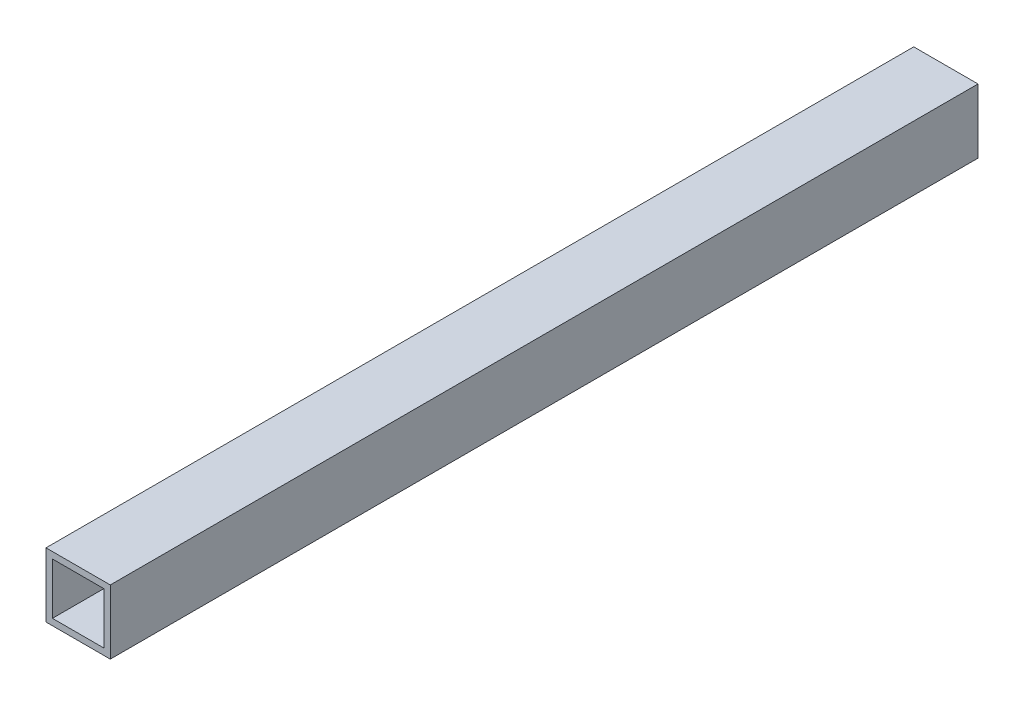
ISO-10303-21;
HEADER;
FILE_DESCRIPTION(('STEP AP214'),'2;1');
FILE_NAME('part.step','',(''),(''),'','','');
FILE_SCHEMA(('AUTOMOTIVE_DESIGN { 1 0 10303 214 1 1 1 1 }'));
ENDSEC;
DATA;
#1=APPLICATION_CONTEXT('core data for automotive mechanical design processes');
#2=APPLICATION_PROTOCOL_DEFINITION('international standard','automotive_design',2000,#1);
#3=PRODUCT_CONTEXT('',#1,'mechanical');
#4=PRODUCT('Part','Part','',(#3));
#5=PRODUCT_RELATED_PRODUCT_CATEGORY('part','',(#4));
#6=PRODUCT_DEFINITION_FORMATION('','',#4);
#7=PRODUCT_DEFINITION_CONTEXT('part definition',#1,'design');
#8=PRODUCT_DEFINITION('design','',#6,#7);
#9=PRODUCT_DEFINITION_SHAPE('','',#8);
#10=(LENGTH_UNIT() NAMED_UNIT(*) SI_UNIT(.MILLI.,.METRE.));
#11=(NAMED_UNIT(*) PLANE_ANGLE_UNIT() SI_UNIT($,.RADIAN.));
#12=(NAMED_UNIT(*) SI_UNIT($,.STERADIAN.) SOLID_ANGLE_UNIT());
#13=UNCERTAINTY_MEASURE_WITH_UNIT(LENGTH_MEASURE(1.E-05),#10,'distance_accuracy_value','');
#14=(GEOMETRIC_REPRESENTATION_CONTEXT(3) GLOBAL_UNCERTAINTY_ASSIGNED_CONTEXT((#13)) GLOBAL_UNIT_ASSIGNED_CONTEXT((#10,
#11,#12)) REPRESENTATION_CONTEXT('',''));
#15=CARTESIAN_POINT('',(0.,0.,0.));
#16=DIRECTION('',(0.,0.,1.));
#17=DIRECTION('',(1.,0.,0.));
#18=AXIS2_PLACEMENT_3D('',#15,#16,#17);
#19=CARTESIAN_POINT('',(-15.875,-15.875,428.625));
#20=DIRECTION('',(0.,0.,1.));
#21=DIRECTION('',(1.,0.,0.));
#22=AXIS2_PLACEMENT_3D('',#19,#20,#21);
#23=PLANE('',#22);
#24=DIRECTION('',(0.,-1.,0.));
#25=VECTOR('',#24,1.);
#26=CARTESIAN_POINT('',(-15.875,15.875,428.625));
#27=LINE('',#26,#25);
#28=CARTESIAN_POINT('',(-15.875,15.875,428.625));
#29=VERTEX_POINT('',#28);
#30=CARTESIAN_POINT('',(-15.875,-15.875,428.625));
#31=VERTEX_POINT('',#30);
#32=EDGE_CURVE('E135',#29,#31,#27,.T.);
#33=ORIENTED_EDGE('',*,*,#32,.T.);
#34=DIRECTION('',(1.,0.,0.));
#35=VECTOR('',#34,1.);
#36=CARTESIAN_POINT('',(-15.875,-15.875,428.625));
#37=LINE('',#36,#35);
#38=CARTESIAN_POINT('',(15.875,-15.875,428.625));
#39=VERTEX_POINT('',#38);
#40=EDGE_CURVE('E138',#31,#39,#37,.T.);
#41=ORIENTED_EDGE('',*,*,#40,.T.);
#42=DIRECTION('',(0.,1.,0.));
#43=VECTOR('',#42,1.);
#44=CARTESIAN_POINT('',(15.875,15.875,428.625));
#45=LINE('',#44,#43);
#46=CARTESIAN_POINT('',(15.875,15.875,428.625));
#47=VERTEX_POINT('',#46);
#48=EDGE_CURVE('E140',#39,#47,#45,.T.);
#49=ORIENTED_EDGE('',*,*,#48,.T.);
#50=DIRECTION('',(-1.,0.,0.));
#51=VECTOR('',#50,1.);
#52=CARTESIAN_POINT('',(-15.875,15.875,428.625));
#53=LINE('',#52,#51);
#54=EDGE_CURVE('E142',#47,#29,#53,.T.);
#55=ORIENTED_EDGE('',*,*,#54,.T.);
#56=EDGE_LOOP('',(#33,#41,#49,#55));
#57=FACE_BOUND('',#56,.T.);
#58=DIRECTION('',(1.,0.,0.));
#59=VECTOR('',#58,1.);
#60=CARTESIAN_POINT('',(-12.7,-12.7,428.625));
#61=LINE('',#60,#59);
#62=CARTESIAN_POINT('',(-12.7,-12.7,428.625));
#63=VERTEX_POINT('',#62);
#64=CARTESIAN_POINT('',(12.7,-12.7,428.625));
#65=VERTEX_POINT('',#64);
#66=EDGE_CURVE('E117',#63,#65,#61,.T.);
#67=ORIENTED_EDGE('',*,*,#66,.F.);
#68=DIRECTION('',(0.,-1.,0.));
#69=VECTOR('',#68,1.);
#70=CARTESIAN_POINT('',(-12.7,12.7,428.625));
#71=LINE('',#70,#69);
#72=CARTESIAN_POINT('',(-12.7,12.7,428.625));
#73=VERTEX_POINT('',#72);
#74=EDGE_CURVE('E106',#73,#63,#71,.T.);
#75=ORIENTED_EDGE('',*,*,#74,.F.);
#76=DIRECTION('',(-1.,0.,0.));
#77=VECTOR('',#76,1.);
#78=CARTESIAN_POINT('',(-12.7,12.7,428.625));
#79=LINE('',#78,#77);
#80=CARTESIAN_POINT('',(12.7,12.7,428.625));
#81=VERTEX_POINT('',#80);
#82=EDGE_CURVE('E121',#81,#73,#79,.T.);
#83=ORIENTED_EDGE('',*,*,#82,.F.);
#84=DIRECTION('',(0.,1.,0.));
#85=VECTOR('',#84,1.);
#86=CARTESIAN_POINT('',(12.7,12.7,428.625));
#87=LINE('',#86,#85);
#88=EDGE_CURVE('E119',#65,#81,#87,.T.);
#89=ORIENTED_EDGE('',*,*,#88,.F.);
#90=EDGE_LOOP('',(#67,#75,#83,#89));
#91=FACE_BOUND('',#90,.T.);
#92=ADVANCED_FACE('F26',(#57,#91),#23,.T.);
#93=CARTESIAN_POINT('',(-15.875,-15.875,0.));
#94=DIRECTION('',(0.,0.,1.));
#95=DIRECTION('',(1.,0.,0.));
#96=AXIS2_PLACEMENT_3D('',#93,#94,#95);
#97=PLANE('',#96);
#98=DIRECTION('',(0.,-1.,0.));
#99=VECTOR('',#98,1.);
#100=CARTESIAN_POINT('',(-15.875,15.875,0.));
#101=LINE('',#100,#99);
#102=CARTESIAN_POINT('',(-15.875,15.875,0.));
#103=VERTEX_POINT('',#102);
#104=CARTESIAN_POINT('',(-15.875,-15.875,0.));
#105=VERTEX_POINT('',#104);
#106=EDGE_CURVE('E107',#103,#105,#101,.T.);
#107=ORIENTED_EDGE('',*,*,#106,.F.);
#108=DIRECTION('',(-1.,0.,0.));
#109=VECTOR('',#108,1.);
#110=CARTESIAN_POINT('',(-15.875,15.875,0.));
#111=LINE('',#110,#109);
#112=CARTESIAN_POINT('',(15.875,15.875,0.));
#113=VERTEX_POINT('',#112);
#114=EDGE_CURVE('E133',#113,#103,#111,.T.);
#115=ORIENTED_EDGE('',*,*,#114,.F.);
#116=DIRECTION('',(0.,1.,0.));
#117=VECTOR('',#116,1.);
#118=CARTESIAN_POINT('',(15.875,15.875,0.));
#119=LINE('',#118,#117);
#120=CARTESIAN_POINT('',(15.875,-15.875,0.));
#121=VERTEX_POINT('',#120);
#122=EDGE_CURVE('E131',#121,#113,#119,.T.);
#123=ORIENTED_EDGE('',*,*,#122,.F.);
#124=DIRECTION('',(1.,0.,0.));
#125=VECTOR('',#124,1.);
#126=CARTESIAN_POINT('',(-15.875,-15.875,0.));
#127=LINE('',#126,#125);
#128=EDGE_CURVE('E129',#105,#121,#127,.T.);
#129=ORIENTED_EDGE('',*,*,#128,.F.);
#130=EDGE_LOOP('',(#107,#115,#123,#129));
#131=FACE_BOUND('',#130,.T.);
#132=DIRECTION('',(0.,-1.,0.));
#133=VECTOR('',#132,1.);
#134=CARTESIAN_POINT('',(-12.7,12.7,0.));
#135=LINE('',#134,#133);
#136=CARTESIAN_POINT('',(-12.7,12.7,0.));
#137=VERTEX_POINT('',#136);
#138=CARTESIAN_POINT('',(-12.7,-12.7,0.));
#139=VERTEX_POINT('',#138);
#140=EDGE_CURVE('E49',#137,#139,#135,.T.);
#141=ORIENTED_EDGE('',*,*,#140,.T.);
#142=DIRECTION('',(1.,0.,0.));
#143=VECTOR('',#142,1.);
#144=CARTESIAN_POINT('',(-12.7,-12.7,0.));
#145=LINE('',#144,#143);
#146=CARTESIAN_POINT('',(12.7,-12.7,0.));
#147=VERTEX_POINT('',#146);
#148=EDGE_CURVE('E93',#139,#147,#145,.T.);
#149=ORIENTED_EDGE('',*,*,#148,.T.);
#150=DIRECTION('',(0.,1.,0.));
#151=VECTOR('',#150,1.);
#152=CARTESIAN_POINT('',(12.7,12.7,0.));
#153=LINE('',#152,#151);
#154=CARTESIAN_POINT('',(12.7,12.7,0.));
#155=VERTEX_POINT('',#154);
#156=EDGE_CURVE('E102',#147,#155,#153,.T.);
#157=ORIENTED_EDGE('',*,*,#156,.T.);
#158=DIRECTION('',(-1.,0.,0.));
#159=VECTOR('',#158,1.);
#160=CARTESIAN_POINT('',(-12.7,12.7,0.));
#161=LINE('',#160,#159);
#162=EDGE_CURVE('E111',#155,#137,#161,.T.);
#163=ORIENTED_EDGE('',*,*,#162,.T.);
#164=EDGE_LOOP('',(#141,#149,#157,#163));
#165=FACE_BOUND('',#164,.T.);
#166=ADVANCED_FACE('F110',(#131,#165),#97,.F.);
#167=CARTESIAN_POINT('',(-15.875,15.875,428.625));
#168=DIRECTION('',(1.,0.,0.));
#169=DIRECTION('',(0.,1.,0.));
#170=AXIS2_PLACEMENT_3D('',#167,#168,#169);
#171=PLANE('',#170);
#172=ORIENTED_EDGE('',*,*,#106,.T.);
#173=DIRECTION('',(0.,0.,-1.));
#174=VECTOR('',#173,1.);
#175=CARTESIAN_POINT('',(-15.875,-15.875,428.625));
#176=LINE('',#175,#174);
#177=EDGE_CURVE('E11',#31,#105,#176,.T.);
#178=ORIENTED_EDGE('',*,*,#177,.F.);
#179=ORIENTED_EDGE('',*,*,#32,.F.);
#180=DIRECTION('',(0.,0.,-1.));
#181=VECTOR('',#180,1.);
#182=CARTESIAN_POINT('',(-15.875,15.875,428.625));
#183=LINE('',#182,#181);
#184=EDGE_CURVE('E144',#29,#103,#183,.T.);
#185=ORIENTED_EDGE('',*,*,#184,.T.);
#186=EDGE_LOOP('',(#172,#178,#179,#185));
#187=FACE_BOUND('',#186,.T.);
#188=ADVANCED_FACE('F28',(#187),#171,.F.);
#189=CARTESIAN_POINT('',(-15.875,-15.875,428.625));
#190=DIRECTION('',(0.,1.,0.));
#191=DIRECTION('',(0.,0.,1.));
#192=AXIS2_PLACEMENT_3D('',#189,#190,#191);
#193=PLANE('',#192);
#194=ORIENTED_EDGE('',*,*,#128,.T.);
#195=DIRECTION('',(0.,0.,-1.));
#196=VECTOR('',#195,1.);
#197=CARTESIAN_POINT('',(15.875,-15.875,428.625));
#198=LINE('',#197,#196);
#199=EDGE_CURVE('E34',#39,#121,#198,.T.);
#200=ORIENTED_EDGE('',*,*,#199,.F.);
#201=ORIENTED_EDGE('',*,*,#40,.F.);
#202=ORIENTED_EDGE('',*,*,#177,.T.);
#203=EDGE_LOOP('',(#194,#200,#201,#202));
#204=FACE_BOUND('',#203,.T.);
#205=ADVANCED_FACE('F169',(#204),#193,.F.);
#206=CARTESIAN_POINT('',(15.875,15.875,428.625));
#207=DIRECTION('',(-1.,0.,0.));
#208=DIRECTION('',(0.,-1.,0.));
#209=AXIS2_PLACEMENT_3D('',#206,#207,#208);
#210=PLANE('',#209);
#211=ORIENTED_EDGE('',*,*,#122,.T.);
#212=DIRECTION('',(0.,0.,-1.));
#213=VECTOR('',#212,1.);
#214=CARTESIAN_POINT('',(15.875,15.875,428.625));
#215=LINE('',#214,#213);
#216=EDGE_CURVE('E147',#47,#113,#215,.T.);
#217=ORIENTED_EDGE('',*,*,#216,.F.);
#218=ORIENTED_EDGE('',*,*,#48,.F.);
#219=ORIENTED_EDGE('',*,*,#199,.T.);
#220=EDGE_LOOP('',(#211,#217,#218,#219));
#221=FACE_BOUND('',#220,.T.);
#222=ADVANCED_FACE('F154',(#221),#210,.F.);
#223=CARTESIAN_POINT('',(-15.875,15.875,428.625));
#224=DIRECTION('',(0.,-1.,0.));
#225=DIRECTION('',(0.,0.,-1.));
#226=AXIS2_PLACEMENT_3D('',#223,#224,#225);
#227=PLANE('',#226);
#228=ORIENTED_EDGE('',*,*,#114,.T.);
#229=ORIENTED_EDGE('',*,*,#184,.F.);
#230=ORIENTED_EDGE('',*,*,#54,.F.);
#231=ORIENTED_EDGE('',*,*,#216,.T.);
#232=EDGE_LOOP('',(#228,#229,#230,#231));
#233=FACE_BOUND('',#232,.T.);
#234=ADVANCED_FACE('F162',(#233),#227,.F.);
#235=CARTESIAN_POINT('',(-12.7,12.7,428.625));
#236=DIRECTION('',(1.,0.,0.));
#237=DIRECTION('',(0.,1.,0.));
#238=AXIS2_PLACEMENT_3D('',#235,#236,#237);
#239=PLANE('',#238);
#240=ORIENTED_EDGE('',*,*,#140,.F.);
#241=DIRECTION('',(0.,0.,-1.));
#242=VECTOR('',#241,1.);
#243=CARTESIAN_POINT('',(-12.7,12.7,428.625));
#244=LINE('',#243,#242);
#245=EDGE_CURVE('E123',#73,#137,#244,.T.);
#246=ORIENTED_EDGE('',*,*,#245,.F.);
#247=ORIENTED_EDGE('',*,*,#74,.T.);
#248=DIRECTION('',(0.,0.,-1.));
#249=VECTOR('',#248,1.);
#250=CARTESIAN_POINT('',(-12.7,-12.7,428.625));
#251=LINE('',#250,#249);
#252=EDGE_CURVE('E95',#63,#139,#251,.T.);
#253=ORIENTED_EDGE('',*,*,#252,.T.);
#254=EDGE_LOOP('',(#240,#246,#247,#253));
#255=FACE_BOUND('',#254,.T.);
#256=ADVANCED_FACE('F104',(#255),#239,.T.);
#257=CARTESIAN_POINT('',(-12.7,-12.7,428.625));
#258=DIRECTION('',(0.,1.,0.));
#259=DIRECTION('',(0.,0.,1.));
#260=AXIS2_PLACEMENT_3D('',#257,#258,#259);
#261=PLANE('',#260);
#262=ORIENTED_EDGE('',*,*,#148,.F.);
#263=ORIENTED_EDGE('',*,*,#252,.F.);
#264=ORIENTED_EDGE('',*,*,#66,.T.);
#265=DIRECTION('',(0.,0.,-1.));
#266=VECTOR('',#265,1.);
#267=CARTESIAN_POINT('',(12.7,-12.7,428.625));
#268=LINE('',#267,#266);
#269=EDGE_CURVE('E98',#65,#147,#268,.T.);
#270=ORIENTED_EDGE('',*,*,#269,.T.);
#271=EDGE_LOOP('',(#262,#263,#264,#270));
#272=FACE_BOUND('',#271,.T.);
#273=ADVANCED_FACE('F94',(#272),#261,.T.);
#274=CARTESIAN_POINT('',(12.7,12.7,428.625));
#275=DIRECTION('',(-1.,0.,0.));
#276=DIRECTION('',(0.,-1.,0.));
#277=AXIS2_PLACEMENT_3D('',#274,#275,#276);
#278=PLANE('',#277);
#279=ORIENTED_EDGE('',*,*,#156,.F.);
#280=ORIENTED_EDGE('',*,*,#269,.F.);
#281=ORIENTED_EDGE('',*,*,#88,.T.);
#282=DIRECTION('',(0.,0.,-1.));
#283=VECTOR('',#282,1.);
#284=CARTESIAN_POINT('',(12.7,12.7,428.625));
#285=LINE('',#284,#283);
#286=EDGE_CURVE('E41',#81,#155,#285,.T.);
#287=ORIENTED_EDGE('',*,*,#286,.T.);
#288=EDGE_LOOP('',(#279,#280,#281,#287));
#289=FACE_BOUND('',#288,.T.);
#290=ADVANCED_FACE('F191',(#289),#278,.T.);
#291=CARTESIAN_POINT('',(-12.7,12.7,428.625));
#292=DIRECTION('',(0.,-1.,0.));
#293=DIRECTION('',(0.,0.,-1.));
#294=AXIS2_PLACEMENT_3D('',#291,#292,#293);
#295=PLANE('',#294);
#296=ORIENTED_EDGE('',*,*,#162,.F.);
#297=ORIENTED_EDGE('',*,*,#286,.F.);
#298=ORIENTED_EDGE('',*,*,#82,.T.);
#299=ORIENTED_EDGE('',*,*,#245,.T.);
#300=EDGE_LOOP('',(#296,#297,#298,#299));
#301=FACE_BOUND('',#300,.T.);
#302=ADVANCED_FACE('F196',(#301),#295,.T.);
#303=CLOSED_SHELL('',(#92,#166,#188,#205,#222,#234,#256,#273,#290,#302));
#304=MANIFOLD_SOLID_BREP('B2',#303);
#305=ADVANCED_BREP_SHAPE_REPRESENTATION('',(#18,#304),#14);
#306=SHAPE_DEFINITION_REPRESENTATION(#9,#305);
ENDSEC;
END-ISO-10303-21;
